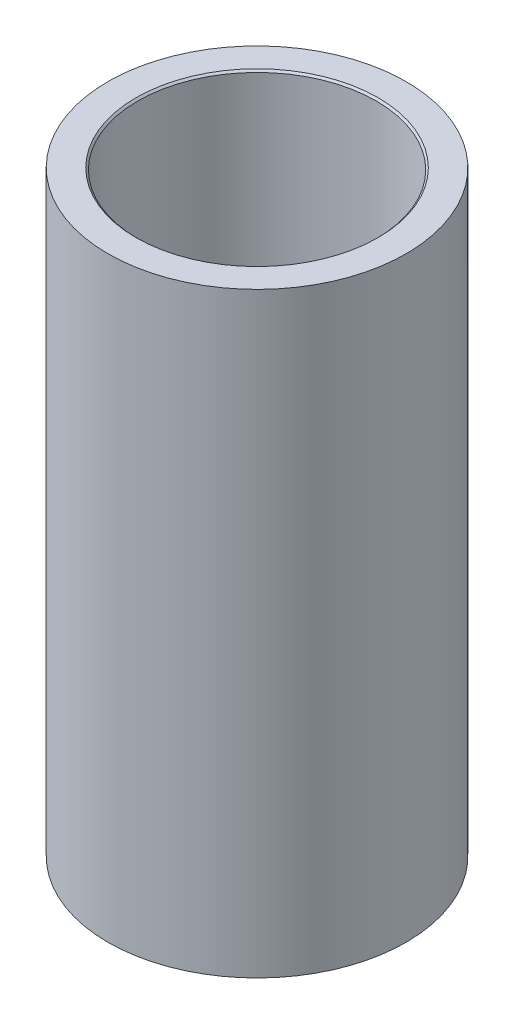
ISO-10303-21;
HEADER;
FILE_DESCRIPTION(('STEP AP214'),'2;1');
FILE_NAME('part.step','',(''),(''),'','','');
FILE_SCHEMA(('AUTOMOTIVE_DESIGN { 1 0 10303 214 1 1 1 1 }'));
ENDSEC;
DATA;
#1=APPLICATION_CONTEXT('core data for automotive mechanical design processes');
#2=APPLICATION_PROTOCOL_DEFINITION('international standard','automotive_design',2000,#1);
#3=PRODUCT_CONTEXT('',#1,'mechanical');
#4=PRODUCT('Part','Part','',(#3));
#5=PRODUCT_RELATED_PRODUCT_CATEGORY('part','',(#4));
#6=PRODUCT_DEFINITION_FORMATION('','',#4);
#7=PRODUCT_DEFINITION_CONTEXT('part definition',#1,'design');
#8=PRODUCT_DEFINITION('design','',#6,#7);
#9=PRODUCT_DEFINITION_SHAPE('','',#8);
#10=(LENGTH_UNIT() NAMED_UNIT(*) SI_UNIT(.MILLI.,.METRE.));
#11=(NAMED_UNIT(*) PLANE_ANGLE_UNIT() SI_UNIT($,.RADIAN.));
#12=(NAMED_UNIT(*) SI_UNIT($,.STERADIAN.) SOLID_ANGLE_UNIT());
#13=UNCERTAINTY_MEASURE_WITH_UNIT(LENGTH_MEASURE(1.E-05),#10,'distance_accuracy_value','');
#14=(GEOMETRIC_REPRESENTATION_CONTEXT(3) GLOBAL_UNCERTAINTY_ASSIGNED_CONTEXT((#13)) GLOBAL_UNIT_ASSIGNED_CONTEXT((#10,
#11,#12)) REPRESENTATION_CONTEXT('',''));
#15=CARTESIAN_POINT('',(0.,0.,0.));
#16=DIRECTION('',(0.,0.,1.));
#17=DIRECTION('',(1.,0.,0.));
#18=AXIS2_PLACEMENT_3D('',#15,#16,#17);
#19=CARTESIAN_POINT('',(0.,8.,0.));
#20=DIRECTION('',(0.,-1.,0.));
#21=DIRECTION('',(0.,0.,-1.));
#22=AXIS2_PLACEMENT_3D('',#19,#20,#21);
#23=CYLINDRICAL_SURFACE('',#22,2.);
#24=CARTESIAN_POINT('',(0.,8.,0.));
#25=DIRECTION('',(0.,1.,0.));
#26=DIRECTION('',(0.,0.,1.));
#27=AXIS2_PLACEMENT_3D('',#24,#25,#26);
#28=CIRCLE('',#27,2.);
#29=CARTESIAN_POINT('',(0.,8.,2.));
#30=VERTEX_POINT('',#29);
#31=EDGE_CURVE('E10',#30,#30,#28,.T.);
#32=ORIENTED_EDGE('',*,*,#31,.F.);
#33=EDGE_LOOP('',(#32));
#34=FACE_BOUND('',#33,.T.);
#35=CARTESIAN_POINT('',(0.,0.,0.));
#36=DIRECTION('',(0.,1.,0.));
#37=DIRECTION('',(0.,0.,1.));
#38=AXIS2_PLACEMENT_3D('',#35,#36,#37);
#39=CIRCLE('',#38,2.);
#40=CARTESIAN_POINT('',(0.,0.,2.));
#41=VERTEX_POINT('',#40);
#42=EDGE_CURVE('E34',#41,#41,#39,.T.);
#43=ORIENTED_EDGE('',*,*,#42,.T.);
#44=EDGE_LOOP('',(#43));
#45=FACE_BOUND('',#44,.T.);
#46=ADVANCED_FACE('F31',(#34,#45),#23,.T.);
#47=CARTESIAN_POINT('',(0.,8.,0.));
#48=DIRECTION('',(0.,1.,0.));
#49=DIRECTION('',(0.,0.,1.));
#50=AXIS2_PLACEMENT_3D('',#47,#48,#49);
#51=PLANE('',#50);
#52=CARTESIAN_POINT('',(0.,8.,0.));
#53=DIRECTION('',(0.,1.,0.));
#54=DIRECTION('',(0.,0.,1.));
#55=AXIS2_PLACEMENT_3D('',#52,#53,#54);
#56=CIRCLE('',#55,1.625);
#57=CARTESIAN_POINT('',(0.,8.,1.625));
#58=VERTEX_POINT('',#57);
#59=EDGE_CURVE('E48',#58,#58,#56,.T.);
#60=ORIENTED_EDGE('',*,*,#59,.F.);
#61=EDGE_LOOP('',(#60));
#62=FACE_BOUND('',#61,.T.);
#63=ORIENTED_EDGE('',*,*,#31,.T.);
#64=EDGE_LOOP('',(#63));
#65=FACE_BOUND('',#64,.T.);
#66=ADVANCED_FACE('F54',(#62,#65),#51,.T.);
#67=CARTESIAN_POINT('',(0.,0.,0.));
#68=DIRECTION('',(0.,1.,0.));
#69=DIRECTION('',(0.,0.,1.));
#70=AXIS2_PLACEMENT_3D('',#67,#68,#69);
#71=PLANE('',#70);
#72=CARTESIAN_POINT('',(0.,0.,0.));
#73=DIRECTION('',(0.,1.,0.));
#74=DIRECTION('',(0.,0.,1.));
#75=AXIS2_PLACEMENT_3D('',#72,#73,#74);
#76=CIRCLE('',#75,1.6);
#77=CARTESIAN_POINT('',(0.,0.,1.6));
#78=VERTEX_POINT('',#77);
#79=EDGE_CURVE('E41',#78,#78,#76,.T.);
#80=ORIENTED_EDGE('',*,*,#79,.T.);
#81=EDGE_LOOP('',(#80));
#82=FACE_BOUND('',#81,.T.);
#83=ORIENTED_EDGE('',*,*,#42,.F.);
#84=EDGE_LOOP('',(#83));
#85=FACE_BOUND('',#84,.T.);
#86=ADVANCED_FACE('F56',(#82,#85),#71,.F.);
#87=CARTESIAN_POINT('',(0.,8.,0.));
#88=DIRECTION('',(0.,1.,0.));
#89=DIRECTION('',(0.,0.,1.));
#90=AXIS2_PLACEMENT_3D('',#87,#88,#89);
#91=CYLINDRICAL_SURFACE('',#90,1.6);
#92=ORIENTED_EDGE('',*,*,#79,.F.);
#93=EDGE_LOOP('',(#92));
#94=FACE_BOUND('',#93,.T.);
#95=CARTESIAN_POINT('',(0.,7.975,0.));
#96=DIRECTION('',(0.,1.,0.));
#97=DIRECTION('',(0.,0.,1.));
#98=AXIS2_PLACEMENT_3D('',#95,#96,#97);
#99=CIRCLE('',#98,1.6);
#100=CARTESIAN_POINT('',(0.,7.975,1.6));
#101=VERTEX_POINT('',#100);
#102=EDGE_CURVE('E45',#101,#101,#99,.T.);
#103=ORIENTED_EDGE('',*,*,#102,.T.);
#104=EDGE_LOOP('',(#103));
#105=FACE_BOUND('',#104,.T.);
#106=ADVANCED_FACE('F62',(#94,#105),#91,.F.);
#107=CARTESIAN_POINT('',(0.,8.,0.));
#108=DIRECTION('',(0.,1.,0.));
#109=DIRECTION('',(0.,0.,1.));
#110=AXIS2_PLACEMENT_3D('',#107,#108,#109);
#111=CONICAL_SURFACE('',#110,1.625,0.785398163397435);
#112=ORIENTED_EDGE('',*,*,#102,.F.);
#113=EDGE_LOOP('',(#112));
#114=FACE_BOUND('',#113,.T.);
#115=ORIENTED_EDGE('',*,*,#59,.T.);
#116=EDGE_LOOP('',(#115));
#117=FACE_BOUND('',#116,.T.);
#118=ADVANCED_FACE('F52',(#114,#117),#111,.F.);
#119=CLOSED_SHELL('',(#46,#66,#86,#106,#118));
#120=MANIFOLD_SOLID_BREP('B2',#119);
#121=ADVANCED_BREP_SHAPE_REPRESENTATION('',(#18,#120),#14);
#122=SHAPE_DEFINITION_REPRESENTATION(#9,#121);
ENDSEC;
END-ISO-10303-21;
